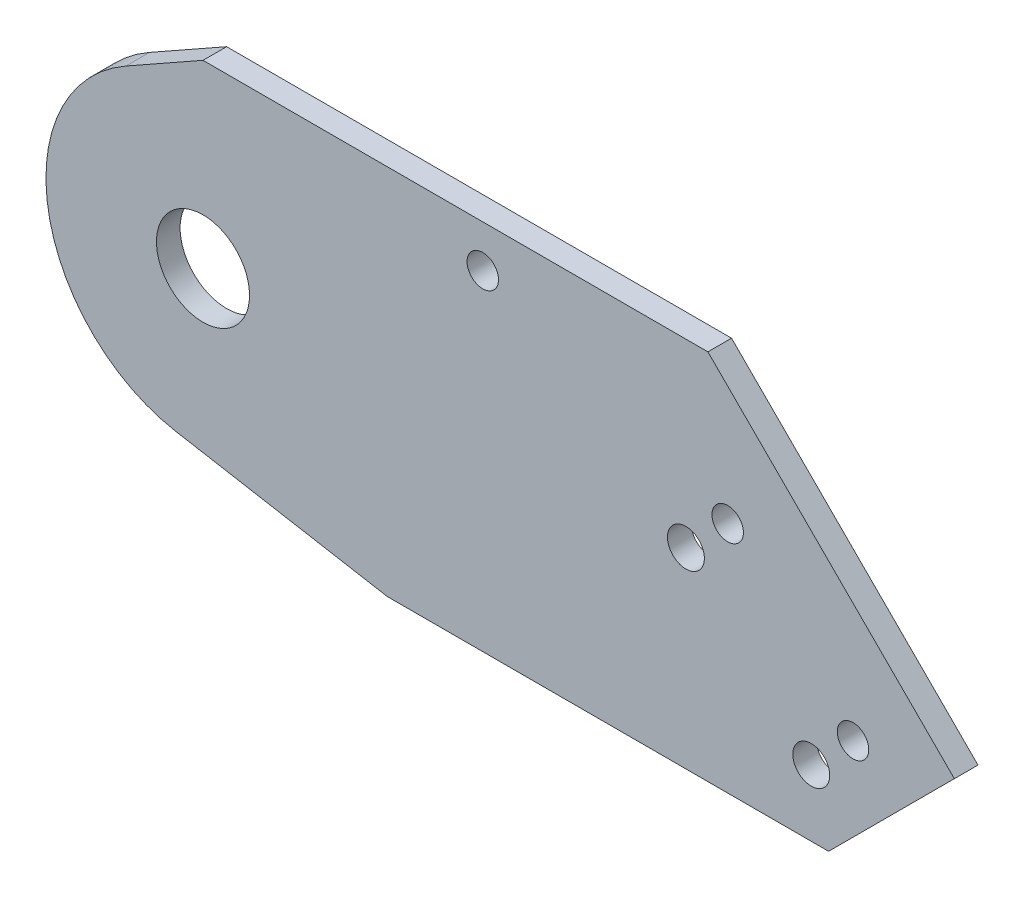
ISO-10303-21;
HEADER;
FILE_DESCRIPTION(('STEP AP214'),'2;1');
FILE_NAME('part.step','',(''),(''),'','','');
FILE_SCHEMA(('AUTOMOTIVE_DESIGN { 1 0 10303 214 1 1 1 1 }'));
ENDSEC;
DATA;
#1=APPLICATION_CONTEXT('core data for automotive mechanical design processes');
#2=APPLICATION_PROTOCOL_DEFINITION('international standard','automotive_design',2000,#1);
#3=PRODUCT_CONTEXT('',#1,'mechanical');
#4=PRODUCT('Part','Part','',(#3));
#5=PRODUCT_RELATED_PRODUCT_CATEGORY('part','',(#4));
#6=PRODUCT_DEFINITION_FORMATION('','',#4);
#7=PRODUCT_DEFINITION_CONTEXT('part definition',#1,'design');
#8=PRODUCT_DEFINITION('design','',#6,#7);
#9=PRODUCT_DEFINITION_SHAPE('','',#8);
#10=(LENGTH_UNIT() NAMED_UNIT(*) SI_UNIT(.MILLI.,.METRE.));
#11=(NAMED_UNIT(*) PLANE_ANGLE_UNIT() SI_UNIT($,.RADIAN.));
#12=(NAMED_UNIT(*) SI_UNIT($,.STERADIAN.) SOLID_ANGLE_UNIT());
#13=UNCERTAINTY_MEASURE_WITH_UNIT(LENGTH_MEASURE(1.E-05),#10,'distance_accuracy_value','');
#14=(GEOMETRIC_REPRESENTATION_CONTEXT(3) GLOBAL_UNCERTAINTY_ASSIGNED_CONTEXT((#13)) GLOBAL_UNIT_ASSIGNED_CONTEXT((#10,
#11,#12)) REPRESENTATION_CONTEXT('',''));
#15=CARTESIAN_POINT('',(0.,0.,0.));
#16=DIRECTION('',(0.,0.,1.));
#17=DIRECTION('',(1.,0.,0.));
#18=AXIS2_PLACEMENT_3D('',#15,#16,#17);
#19=CARTESIAN_POINT('',(0.,0.,2.032));
#20=DIRECTION('',(0.,0.,1.));
#21=DIRECTION('',(1.,0.,0.));
#22=AXIS2_PLACEMENT_3D('',#19,#20,#21);
#23=PLANE('',#22);
#24=CARTESIAN_POINT('',(55.8833357109557,-7.21452782203279,2.032));
#25=DIRECTION('',(0.,0.,-1.));
#26=DIRECTION('',(-1.,0.,0.));
#27=AXIS2_PLACEMENT_3D('',#24,#25,#26);
#28=CIRCLE('',#27,1.35254999999999);
#29=CARTESIAN_POINT('',(54.5307857109557,-7.21452782203279,2.032));
#30=VERTEX_POINT('',#29);
#31=EDGE_CURVE('E202',#30,#30,#28,.T.);
#32=ORIENTED_EDGE('',*,*,#31,.T.);
#33=EDGE_LOOP('',(#32));
#34=FACE_BOUND('',#33,.T.);
#35=CARTESIAN_POINT('',(45.1070283656727,3.5617795232502,2.032));
#36=DIRECTION('',(0.,0.,-1.));
#37=DIRECTION('',(-1.,0.,0.));
#38=AXIS2_PLACEMENT_3D('',#35,#36,#37);
#39=CIRCLE('',#38,1.35254999999999);
#40=CARTESIAN_POINT('',(43.7544783656727,3.5617795232502,2.032));
#41=VERTEX_POINT('',#40);
#42=EDGE_CURVE('E196',#41,#41,#39,.T.);
#43=ORIENTED_EDGE('',*,*,#42,.T.);
#44=EDGE_LOOP('',(#43));
#45=FACE_BOUND('',#44,.T.);
#46=CARTESIAN_POINT('',(52.291233262528,-10.8066302704605,2.032));
#47=DIRECTION('',(0.,0.,-1.));
#48=DIRECTION('',(-1.,0.,0.));
#49=AXIS2_PLACEMENT_3D('',#46,#47,#48);
#50=CIRCLE('',#49,1.5875);
#51=CARTESIAN_POINT('',(50.703733262528,-10.8066302704605,2.032));
#52=VERTEX_POINT('',#51);
#53=EDGE_CURVE('E190',#52,#52,#50,.T.);
#54=ORIENTED_EDGE('',*,*,#53,.T.);
#55=EDGE_LOOP('',(#54));
#56=FACE_BOUND('',#55,.T.);
#57=CARTESIAN_POINT('',(41.514925917245,-0.0303229251774617,2.032));
#58=DIRECTION('',(0.,0.,-1.));
#59=DIRECTION('',(-1.,0.,0.));
#60=AXIS2_PLACEMENT_3D('',#57,#58,#59);
#61=CIRCLE('',#60,1.5875);
#62=CARTESIAN_POINT('',(39.927425917245,-0.0303229251774617,2.032));
#63=VERTEX_POINT('',#62);
#64=EDGE_CURVE('E184',#63,#63,#61,.T.);
#65=ORIENTED_EDGE('',*,*,#64,.T.);
#66=EDGE_LOOP('',(#65));
#67=FACE_BOUND('',#66,.T.);
#68=CARTESIAN_POINT('',(0.,0.,2.032));
#69=DIRECTION('',(0.,0.,1.));
#70=DIRECTION('',(1.,0.,0.));
#71=AXIS2_PLACEMENT_3D('',#68,#69,#70);
#72=CIRCLE('',#71,4.);
#73=CARTESIAN_POINT('',(4.,0.,2.032));
#74=VERTEX_POINT('',#73);
#75=EDGE_CURVE('E142',#74,#74,#72,.T.);
#76=ORIENTED_EDGE('',*,*,#75,.F.);
#77=EDGE_LOOP('',(#76));
#78=FACE_BOUND('',#77,.T.);
#79=DIRECTION('',(0.707106781186547,0.707106781186548,0.));
#80=VECTOR('',#79,1.);
#81=CARTESIAN_POINT('',(64.5941841483928,-5.68788428145106,2.032));
#82=LINE('',#81,#80);
#83=CARTESIAN_POINT('',(53.7820684298438,-16.5,2.032));
#84=VERTEX_POINT('',#83);
#85=CARTESIAN_POINT('',(64.5941841483928,-5.68788428145106,2.032));
#86=VERTEX_POINT('',#85);
#87=EDGE_CURVE('E151',#84,#86,#82,.T.);
#88=ORIENTED_EDGE('',*,*,#87,.T.);
#89=DIRECTION('',(-0.707106781186548,0.707106781186548,0.));
#90=VECTOR('',#89,1.);
#91=CARTESIAN_POINT('',(64.5941841483928,-5.68788428145106,2.032));
#92=LINE('',#91,#90);
#93=CARTESIAN_POINT('',(43.4062998669417,15.5,2.032));
#94=VERTEX_POINT('',#93);
#95=EDGE_CURVE('E104',#86,#94,#92,.T.);
#96=ORIENTED_EDGE('',*,*,#95,.T.);
#97=DIRECTION('',(-1.,0.,0.));
#98=VECTOR('',#97,1.);
#99=CARTESIAN_POINT('',(0.,15.5,2.032));
#100=LINE('',#99,#98);
#101=CARTESIAN_POINT('',(0.,15.5,2.032));
#102=VERTEX_POINT('',#101);
#103=EDGE_CURVE('E163',#94,#102,#100,.T.);
#104=ORIENTED_EDGE('',*,*,#103,.T.);
#105=DIRECTION('',(-0.870967741935482,-0.49134020037832,0.));
#106=VECTOR('',#105,1.);
#107=CARTESIAN_POINT('',(-6.63309270510731,11.758064516129,2.032));
#108=LINE('',#107,#106);
#109=CARTESIAN_POINT('',(-6.63309270510731,11.758064516129,2.032));
#110=VERTEX_POINT('',#109);
#111=EDGE_CURVE('E120',#102,#110,#108,.T.);
#112=ORIENTED_EDGE('',*,*,#111,.T.);
#113=CARTESIAN_POINT('',(0.,0.,2.032));
#114=DIRECTION('',(0.,0.,1.));
#115=DIRECTION('',(1.,0.,0.));
#116=AXIS2_PLACEMENT_3D('',#113,#114,#115);
#117=CIRCLE('',#116,13.5);
#118=CARTESIAN_POINT('',(-2.34425039850357,-13.2949046656648,2.032));
#119=VERTEX_POINT('',#118);
#120=EDGE_CURVE('E114',#110,#119,#117,.T.);
#121=ORIENTED_EDGE('',*,*,#120,.T.);
#122=DIRECTION('',(0.984807753012208,-0.173648177666931,0.));
#123=VECTOR('',#122,1.);
#124=CARTESIAN_POINT('',(-2.34425039850357,-13.2949046656648,2.032));
#125=LINE('',#124,#123);
#126=CARTESIAN_POINT('',(15.8327485012531,-16.5,2.032));
#127=VERTEX_POINT('',#126);
#128=EDGE_CURVE('E118',#119,#127,#125,.T.);
#129=ORIENTED_EDGE('',*,*,#128,.T.);
#130=DIRECTION('',(1.,0.,0.));
#131=VECTOR('',#130,1.);
#132=CARTESIAN_POINT('',(15.8327485012531,-16.5,2.032));
#133=LINE('',#132,#131);
#134=EDGE_CURVE('E64',#127,#84,#133,.T.);
#135=ORIENTED_EDGE('',*,*,#134,.T.);
#136=EDGE_LOOP('',(#88,#96,#104,#112,#121,#129,#135));
#137=FACE_BOUND('',#136,.T.);
#138=CARTESIAN_POINT('',(24.0532446160567,11.8675875071896,2.032));
#139=DIRECTION('',(0.,0.,1.));
#140=DIRECTION('',(1.,0.,0.));
#141=AXIS2_PLACEMENT_3D('',#138,#139,#140);
#142=CIRCLE('',#141,1.35255);
#143=CARTESIAN_POINT('',(25.4057946160567,11.8675875071896,2.032));
#144=VERTEX_POINT('',#143);
#145=EDGE_CURVE('E178',#144,#144,#142,.T.);
#146=ORIENTED_EDGE('',*,*,#145,.F.);
#147=EDGE_LOOP('',(#146));
#148=FACE_BOUND('',#147,.T.);
#149=ADVANCED_FACE('F47',(#34,#45,#56,#67,#78,#137,#148),#23,.T.);
#150=CARTESIAN_POINT('',(0.,0.,0.));
#151=DIRECTION('',(0.,0.,1.));
#152=DIRECTION('',(1.,0.,0.));
#153=AXIS2_PLACEMENT_3D('',#150,#151,#152);
#154=PLANE('',#153);
#155=CARTESIAN_POINT('',(55.8833357109557,-7.21452782203279,0.));
#156=DIRECTION('',(0.,0.,-1.));
#157=DIRECTION('',(-1.,0.,0.));
#158=AXIS2_PLACEMENT_3D('',#155,#156,#157);
#159=CIRCLE('',#158,1.35254999999999);
#160=CARTESIAN_POINT('',(54.5307857109557,-7.21452782203279,0.));
#161=VERTEX_POINT('',#160);
#162=EDGE_CURVE('E205',#161,#161,#159,.T.);
#163=ORIENTED_EDGE('',*,*,#162,.F.);
#164=EDGE_LOOP('',(#163));
#165=FACE_BOUND('',#164,.T.);
#166=CARTESIAN_POINT('',(45.1070283656727,3.5617795232502,0.));
#167=DIRECTION('',(0.,0.,-1.));
#168=DIRECTION('',(-1.,0.,0.));
#169=AXIS2_PLACEMENT_3D('',#166,#167,#168);
#170=CIRCLE('',#169,1.35254999999999);
#171=CARTESIAN_POINT('',(43.7544783656727,3.5617795232502,0.));
#172=VERTEX_POINT('',#171);
#173=EDGE_CURVE('E199',#172,#172,#170,.T.);
#174=ORIENTED_EDGE('',*,*,#173,.F.);
#175=EDGE_LOOP('',(#174));
#176=FACE_BOUND('',#175,.T.);
#177=CARTESIAN_POINT('',(52.291233262528,-10.8066302704605,0.));
#178=DIRECTION('',(0.,0.,-1.));
#179=DIRECTION('',(-1.,0.,0.));
#180=AXIS2_PLACEMENT_3D('',#177,#178,#179);
#181=CIRCLE('',#180,1.5875);
#182=CARTESIAN_POINT('',(50.703733262528,-10.8066302704605,0.));
#183=VERTEX_POINT('',#182);
#184=EDGE_CURVE('E193',#183,#183,#181,.T.);
#185=ORIENTED_EDGE('',*,*,#184,.F.);
#186=EDGE_LOOP('',(#185));
#187=FACE_BOUND('',#186,.T.);
#188=CARTESIAN_POINT('',(41.514925917245,-0.0303229251774617,0.));
#189=DIRECTION('',(0.,0.,-1.));
#190=DIRECTION('',(-1.,0.,0.));
#191=AXIS2_PLACEMENT_3D('',#188,#189,#190);
#192=CIRCLE('',#191,1.5875);
#193=CARTESIAN_POINT('',(39.927425917245,-0.0303229251774617,0.));
#194=VERTEX_POINT('',#193);
#195=EDGE_CURVE('E187',#194,#194,#192,.T.);
#196=ORIENTED_EDGE('',*,*,#195,.F.);
#197=EDGE_LOOP('',(#196));
#198=FACE_BOUND('',#197,.T.);
#199=DIRECTION('',(0.707106781186547,0.707106781186548,0.));
#200=VECTOR('',#199,1.);
#201=CARTESIAN_POINT('',(64.5941841483928,-5.68788428145106,0.));
#202=LINE('',#201,#200);
#203=CARTESIAN_POINT('',(53.7820684298438,-16.5,0.));
#204=VERTEX_POINT('',#203);
#205=CARTESIAN_POINT('',(64.5941841483928,-5.68788428145106,0.));
#206=VERTEX_POINT('',#205);
#207=EDGE_CURVE('E138',#204,#206,#202,.T.);
#208=ORIENTED_EDGE('',*,*,#207,.F.);
#209=DIRECTION('',(1.,0.,0.));
#210=VECTOR('',#209,1.);
#211=CARTESIAN_POINT('',(15.8327485012531,-16.5,0.));
#212=LINE('',#211,#210);
#213=CARTESIAN_POINT('',(15.8327485012531,-16.5,0.));
#214=VERTEX_POINT('',#213);
#215=EDGE_CURVE('E96',#214,#204,#212,.T.);
#216=ORIENTED_EDGE('',*,*,#215,.F.);
#217=DIRECTION('',(0.984807753012208,-0.173648177666931,0.));
#218=VECTOR('',#217,1.);
#219=CARTESIAN_POINT('',(-2.34425039850357,-13.2949046656648,0.));
#220=LINE('',#219,#218);
#221=CARTESIAN_POINT('',(-2.34425039850357,-13.2949046656648,0.));
#222=VERTEX_POINT('',#221);
#223=EDGE_CURVE('E90',#222,#214,#220,.T.);
#224=ORIENTED_EDGE('',*,*,#223,.F.);
#225=CARTESIAN_POINT('',(0.,0.,0.));
#226=DIRECTION('',(0.,0.,1.));
#227=DIRECTION('',(1.,0.,0.));
#228=AXIS2_PLACEMENT_3D('',#225,#226,#227);
#229=CIRCLE('',#228,13.5);
#230=CARTESIAN_POINT('',(-6.63309270510731,11.758064516129,0.));
#231=VERTEX_POINT('',#230);
#232=EDGE_CURVE('E128',#231,#222,#229,.T.);
#233=ORIENTED_EDGE('',*,*,#232,.F.);
#234=DIRECTION('',(-0.870967741935482,-0.49134020037832,0.));
#235=VECTOR('',#234,1.);
#236=CARTESIAN_POINT('',(-6.63309270510731,11.758064516129,0.));
#237=LINE('',#236,#235);
#238=CARTESIAN_POINT('',(0.,15.5,0.));
#239=VERTEX_POINT('',#238);
#240=EDGE_CURVE('E146',#239,#231,#237,.T.);
#241=ORIENTED_EDGE('',*,*,#240,.F.);
#242=DIRECTION('',(-1.,0.,0.));
#243=VECTOR('',#242,1.);
#244=CARTESIAN_POINT('',(0.,15.5,0.));
#245=LINE('',#244,#243);
#246=CARTESIAN_POINT('',(43.4062998669417,15.5,0.));
#247=VERTEX_POINT('',#246);
#248=EDGE_CURVE('E144',#247,#239,#245,.T.);
#249=ORIENTED_EDGE('',*,*,#248,.F.);
#250=DIRECTION('',(-0.707106781186548,0.707106781186548,0.));
#251=VECTOR('',#250,1.);
#252=CARTESIAN_POINT('',(64.5941841483928,-5.68788428145106,0.));
#253=LINE('',#252,#251);
#254=EDGE_CURVE('E141',#206,#247,#253,.T.);
#255=ORIENTED_EDGE('',*,*,#254,.F.);
#256=EDGE_LOOP('',(#208,#216,#224,#233,#241,#249,#255));
#257=FACE_BOUND('',#256,.T.);
#258=CARTESIAN_POINT('',(0.,0.,0.));
#259=DIRECTION('',(0.,0.,1.));
#260=DIRECTION('',(1.,0.,0.));
#261=AXIS2_PLACEMENT_3D('',#258,#259,#260);
#262=CIRCLE('',#261,4.);
#263=CARTESIAN_POINT('',(4.,0.,0.));
#264=VERTEX_POINT('',#263);
#265=EDGE_CURVE('E175',#264,#264,#262,.T.);
#266=ORIENTED_EDGE('',*,*,#265,.T.);
#267=EDGE_LOOP('',(#266));
#268=FACE_BOUND('',#267,.T.);
#269=CARTESIAN_POINT('',(24.0532446160567,11.8675875071896,0.));
#270=DIRECTION('',(0.,0.,1.));
#271=DIRECTION('',(1.,0.,0.));
#272=AXIS2_PLACEMENT_3D('',#269,#270,#271);
#273=CIRCLE('',#272,1.35255);
#274=CARTESIAN_POINT('',(25.4057946160567,11.8675875071896,0.));
#275=VERTEX_POINT('',#274);
#276=EDGE_CURVE('E181',#275,#275,#273,.T.);
#277=ORIENTED_EDGE('',*,*,#276,.T.);
#278=EDGE_LOOP('',(#277));
#279=FACE_BOUND('',#278,.T.);
#280=ADVANCED_FACE('F167',(#165,#176,#187,#198,#257,#268,#279),#154,.F.);
#281=CARTESIAN_POINT('',(64.5941841483928,-5.68788428145106,2.032));
#282=DIRECTION('',(-0.707106781186548,0.707106781186547,0.));
#283=DIRECTION('',(-0.707106781186547,-0.707106781186548,0.));
#284=AXIS2_PLACEMENT_3D('',#281,#282,#283);
#285=PLANE('',#284);
#286=ORIENTED_EDGE('',*,*,#207,.T.);
#287=DIRECTION('',(0.,0.,-1.));
#288=VECTOR('',#287,1.);
#289=CARTESIAN_POINT('',(64.5941841483928,-5.68788428145106,2.032));
#290=LINE('',#289,#288);
#291=EDGE_CURVE('E13',#86,#206,#290,.T.);
#292=ORIENTED_EDGE('',*,*,#291,.F.);
#293=ORIENTED_EDGE('',*,*,#87,.F.);
#294=DIRECTION('',(0.,0.,-1.));
#295=VECTOR('',#294,1.);
#296=CARTESIAN_POINT('',(53.7820684298438,-16.5,2.032));
#297=LINE('',#296,#295);
#298=EDGE_CURVE('E134',#84,#204,#297,.T.);
#299=ORIENTED_EDGE('',*,*,#298,.T.);
#300=EDGE_LOOP('',(#286,#292,#293,#299));
#301=FACE_BOUND('',#300,.T.);
#302=ADVANCED_FACE('F49',(#301),#285,.F.);
#303=CARTESIAN_POINT('',(64.5941841483928,-5.68788428145106,2.032));
#304=DIRECTION('',(-0.707106781186548,-0.707106781186548,0.));
#305=DIRECTION('',(0.707106781186548,-0.707106781186548,0.));
#306=AXIS2_PLACEMENT_3D('',#303,#304,#305);
#307=PLANE('',#306);
#308=ORIENTED_EDGE('',*,*,#254,.T.);
#309=DIRECTION('',(0.,0.,-1.));
#310=VECTOR('',#309,1.);
#311=CARTESIAN_POINT('',(43.4062998669417,15.5,2.032));
#312=LINE('',#311,#310);
#313=EDGE_CURVE('E56',#94,#247,#312,.T.);
#314=ORIENTED_EDGE('',*,*,#313,.F.);
#315=ORIENTED_EDGE('',*,*,#95,.F.);
#316=ORIENTED_EDGE('',*,*,#291,.T.);
#317=EDGE_LOOP('',(#308,#314,#315,#316));
#318=FACE_BOUND('',#317,.T.);
#319=ADVANCED_FACE('F261',(#318),#307,.F.);
#320=CARTESIAN_POINT('',(0.,15.5,2.032));
#321=DIRECTION('',(0.,-1.,0.));
#322=DIRECTION('',(0.,0.,-1.));
#323=AXIS2_PLACEMENT_3D('',#320,#321,#322);
#324=PLANE('',#323);
#325=ORIENTED_EDGE('',*,*,#248,.T.);
#326=DIRECTION('',(0.,0.,-1.));
#327=VECTOR('',#326,1.);
#328=CARTESIAN_POINT('',(0.,15.5,2.032));
#329=LINE('',#328,#327);
#330=EDGE_CURVE('E155',#102,#239,#329,.T.);
#331=ORIENTED_EDGE('',*,*,#330,.F.);
#332=ORIENTED_EDGE('',*,*,#103,.F.);
#333=ORIENTED_EDGE('',*,*,#313,.T.);
#334=EDGE_LOOP('',(#325,#331,#332,#333));
#335=FACE_BOUND('',#334,.T.);
#336=ADVANCED_FACE('F161',(#335),#324,.F.);
#337=CARTESIAN_POINT('',(-6.63309270510731,11.758064516129,2.032));
#338=DIRECTION('',(0.49134020037832,-0.870967741935482,0.));
#339=DIRECTION('',(0.870967741935482,0.49134020037832,0.));
#340=AXIS2_PLACEMENT_3D('',#337,#338,#339);
#341=PLANE('',#340);
#342=ORIENTED_EDGE('',*,*,#240,.T.);
#343=DIRECTION('',(0.,0.,-1.));
#344=VECTOR('',#343,1.);
#345=CARTESIAN_POINT('',(-6.63309270510731,11.758064516129,2.032));
#346=LINE('',#345,#344);
#347=EDGE_CURVE('E129',#110,#231,#346,.T.);
#348=ORIENTED_EDGE('',*,*,#347,.F.);
#349=ORIENTED_EDGE('',*,*,#111,.F.);
#350=ORIENTED_EDGE('',*,*,#330,.T.);
#351=EDGE_LOOP('',(#342,#348,#349,#350));
#352=FACE_BOUND('',#351,.T.);
#353=ADVANCED_FACE('F170',(#352),#341,.F.);
#354=CARTESIAN_POINT('',(0.,0.,2.032));
#355=DIRECTION('',(0.,0.,-1.));
#356=DIRECTION('',(-1.,0.,0.));
#357=AXIS2_PLACEMENT_3D('',#354,#355,#356);
#358=CYLINDRICAL_SURFACE('',#357,13.5);
#359=ORIENTED_EDGE('',*,*,#232,.T.);
#360=DIRECTION('',(0.,0.,-1.));
#361=VECTOR('',#360,1.);
#362=CARTESIAN_POINT('',(-2.34425039850357,-13.2949046656648,2.032));
#363=LINE('',#362,#361);
#364=EDGE_CURVE('E125',#119,#222,#363,.T.);
#365=ORIENTED_EDGE('',*,*,#364,.F.);
#366=ORIENTED_EDGE('',*,*,#120,.F.);
#367=ORIENTED_EDGE('',*,*,#347,.T.);
#368=EDGE_LOOP('',(#359,#365,#366,#367));
#369=FACE_BOUND('',#368,.T.);
#370=ADVANCED_FACE('F126',(#369),#358,.T.);
#371=CARTESIAN_POINT('',(-2.34425039850357,-13.2949046656648,2.032));
#372=DIRECTION('',(0.173648177666931,0.984807753012208,0.));
#373=DIRECTION('',(-0.984807753012208,0.173648177666931,0.));
#374=AXIS2_PLACEMENT_3D('',#371,#372,#373);
#375=PLANE('',#374);
#376=ORIENTED_EDGE('',*,*,#223,.T.);
#377=DIRECTION('',(0.,0.,-1.));
#378=VECTOR('',#377,1.);
#379=CARTESIAN_POINT('',(15.8327485012531,-16.5,2.032));
#380=LINE('',#379,#378);
#381=EDGE_CURVE('E130',#127,#214,#380,.T.);
#382=ORIENTED_EDGE('',*,*,#381,.F.);
#383=ORIENTED_EDGE('',*,*,#128,.F.);
#384=ORIENTED_EDGE('',*,*,#364,.T.);
#385=EDGE_LOOP('',(#376,#382,#383,#384));
#386=FACE_BOUND('',#385,.T.);
#387=ADVANCED_FACE('F132',(#386),#375,.F.);
#388=CARTESIAN_POINT('',(15.8327485012531,-16.5,2.032));
#389=DIRECTION('',(0.,1.,0.));
#390=DIRECTION('',(-1.,0.,0.));
#391=AXIS2_PLACEMENT_3D('',#388,#389,#390);
#392=PLANE('',#391);
#393=ORIENTED_EDGE('',*,*,#215,.T.);
#394=ORIENTED_EDGE('',*,*,#298,.F.);
#395=ORIENTED_EDGE('',*,*,#134,.F.);
#396=ORIENTED_EDGE('',*,*,#381,.T.);
#397=EDGE_LOOP('',(#393,#394,#395,#396));
#398=FACE_BOUND('',#397,.T.);
#399=ADVANCED_FACE('F251',(#398),#392,.F.);
#400=CARTESIAN_POINT('',(0.,0.,2.032));
#401=DIRECTION('',(0.,0.,-1.));
#402=DIRECTION('',(-1.,0.,0.));
#403=AXIS2_PLACEMENT_3D('',#400,#401,#402);
#404=CYLINDRICAL_SURFACE('',#403,4.);
#405=ORIENTED_EDGE('',*,*,#75,.T.);
#406=EDGE_LOOP('',(#405));
#407=FACE_BOUND('',#406,.T.);
#408=ORIENTED_EDGE('',*,*,#265,.F.);
#409=EDGE_LOOP('',(#408));
#410=FACE_BOUND('',#409,.T.);
#411=ADVANCED_FACE('F241',(#407,#410),#404,.F.);
#412=CARTESIAN_POINT('',(24.0532446160567,11.8675875071896,2.032));
#413=DIRECTION('',(0.,0.,-1.));
#414=DIRECTION('',(-1.,0.,0.));
#415=AXIS2_PLACEMENT_3D('',#412,#413,#414);
#416=CYLINDRICAL_SURFACE('',#415,1.35255);
#417=ORIENTED_EDGE('',*,*,#145,.T.);
#418=EDGE_LOOP('',(#417));
#419=FACE_BOUND('',#418,.T.);
#420=ORIENTED_EDGE('',*,*,#276,.F.);
#421=EDGE_LOOP('',(#420));
#422=FACE_BOUND('',#421,.T.);
#423=ADVANCED_FACE('F232',(#419,#422),#416,.F.);
#424=CARTESIAN_POINT('',(41.514925917245,-0.0303229251774617,2.032));
#425=DIRECTION('',(0.,0.,-1.));
#426=DIRECTION('',(-1.,0.,0.));
#427=AXIS2_PLACEMENT_3D('',#424,#425,#426);
#428=CYLINDRICAL_SURFACE('',#427,1.5875);
#429=ORIENTED_EDGE('',*,*,#64,.F.);
#430=EDGE_LOOP('',(#429));
#431=FACE_BOUND('',#430,.T.);
#432=ORIENTED_EDGE('',*,*,#195,.T.);
#433=EDGE_LOOP('',(#432));
#434=FACE_BOUND('',#433,.T.);
#435=ADVANCED_FACE('F229',(#431,#434),#428,.F.);
#436=CARTESIAN_POINT('',(52.291233262528,-10.8066302704605,2.032));
#437=DIRECTION('',(0.,0.,-1.));
#438=DIRECTION('',(-1.,0.,0.));
#439=AXIS2_PLACEMENT_3D('',#436,#437,#438);
#440=CYLINDRICAL_SURFACE('',#439,1.5875);
#441=ORIENTED_EDGE('',*,*,#53,.F.);
#442=EDGE_LOOP('',(#441));
#443=FACE_BOUND('',#442,.T.);
#444=ORIENTED_EDGE('',*,*,#184,.T.);
#445=EDGE_LOOP('',(#444));
#446=FACE_BOUND('',#445,.T.);
#447=ADVANCED_FACE('F231',(#443,#446),#440,.F.);
#448=CARTESIAN_POINT('',(45.1070283656727,3.5617795232502,2.032));
#449=DIRECTION('',(0.,0.,-1.));
#450=DIRECTION('',(-1.,0.,0.));
#451=AXIS2_PLACEMENT_3D('',#448,#449,#450);
#452=CYLINDRICAL_SURFACE('',#451,1.35254999999999);
#453=ORIENTED_EDGE('',*,*,#42,.F.);
#454=EDGE_LOOP('',(#453));
#455=FACE_BOUND('',#454,.T.);
#456=ORIENTED_EDGE('',*,*,#173,.T.);
#457=EDGE_LOOP('',(#456));
#458=FACE_BOUND('',#457,.T.);
#459=ADVANCED_FACE('F216',(#455,#458),#452,.F.);
#460=CARTESIAN_POINT('',(55.8833357109557,-7.21452782203279,2.032));
#461=DIRECTION('',(0.,0.,-1.));
#462=DIRECTION('',(-1.,0.,0.));
#463=AXIS2_PLACEMENT_3D('',#460,#461,#462);
#464=CYLINDRICAL_SURFACE('',#463,1.35254999999999);
#465=ORIENTED_EDGE('',*,*,#31,.F.);
#466=EDGE_LOOP('',(#465));
#467=FACE_BOUND('',#466,.T.);
#468=ORIENTED_EDGE('',*,*,#162,.T.);
#469=EDGE_LOOP('',(#468));
#470=FACE_BOUND('',#469,.T.);
#471=ADVANCED_FACE('F213',(#467,#470),#464,.F.);
#472=CLOSED_SHELL('',(#149,#280,#302,#319,#336,#353,#370,#387,#399,#411,#423,#435,#447,#459,#471));
#473=MANIFOLD_SOLID_BREP('B2',#472);
#474=ADVANCED_BREP_SHAPE_REPRESENTATION('',(#18,#473),#14);
#475=SHAPE_DEFINITION_REPRESENTATION(#9,#474);
ENDSEC;
END-ISO-10303-21;
